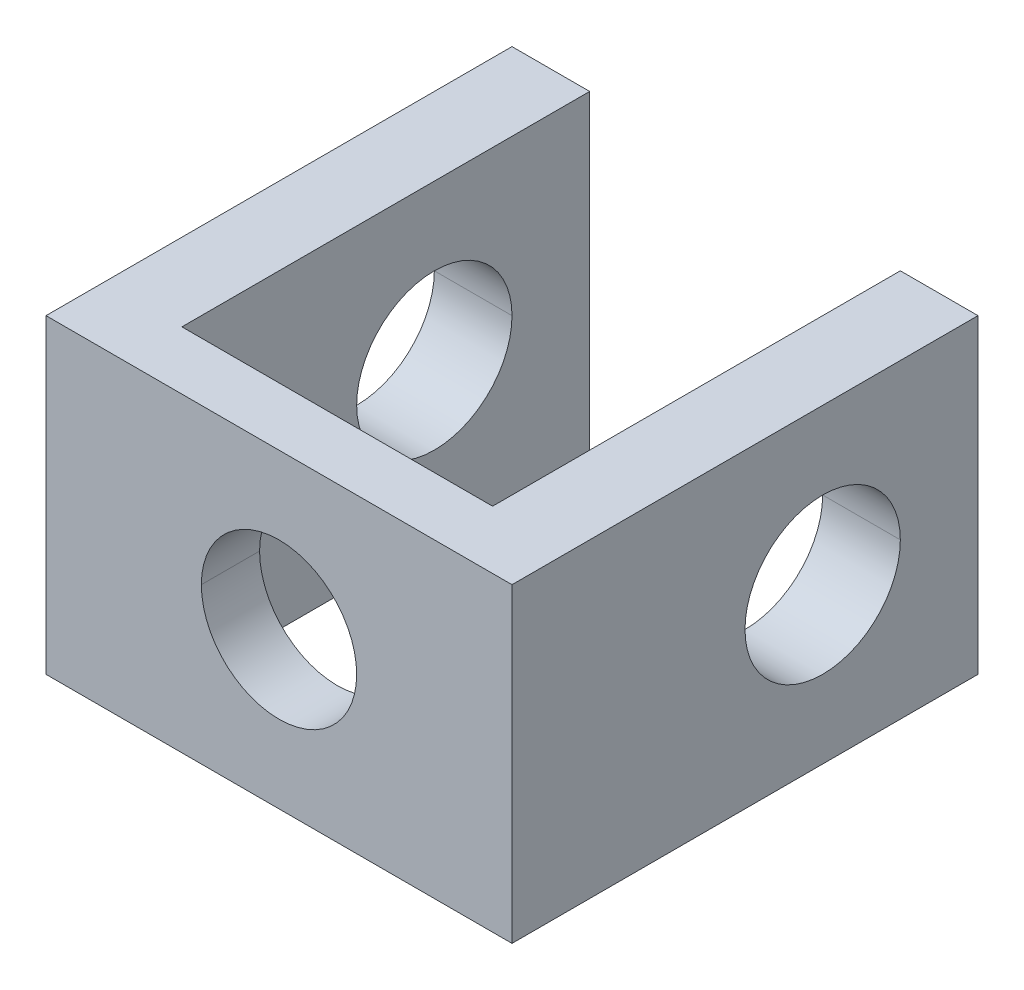
ISO-10303-21;
HEADER;
FILE_DESCRIPTION(('STEP AP214'),'2;1');
FILE_NAME('part.step','',(''),(''),'','','');
FILE_SCHEMA(('AUTOMOTIVE_DESIGN { 1 0 10303 214 1 1 1 1 }'));
ENDSEC;
DATA;
#1=APPLICATION_CONTEXT('core data for automotive mechanical design processes');
#2=APPLICATION_PROTOCOL_DEFINITION('international standard','automotive_design',2000,#1);
#3=PRODUCT_CONTEXT('',#1,'mechanical');
#4=PRODUCT('Part','Part','',(#3));
#5=PRODUCT_RELATED_PRODUCT_CATEGORY('part','',(#4));
#6=PRODUCT_DEFINITION_FORMATION('','',#4);
#7=PRODUCT_DEFINITION_CONTEXT('part definition',#1,'design');
#8=PRODUCT_DEFINITION('design','',#6,#7);
#9=PRODUCT_DEFINITION_SHAPE('','',#8);
#10=(LENGTH_UNIT() NAMED_UNIT(*) SI_UNIT(.MILLI.,.METRE.));
#11=(NAMED_UNIT(*) PLANE_ANGLE_UNIT() SI_UNIT($,.RADIAN.));
#12=(NAMED_UNIT(*) SI_UNIT($,.STERADIAN.) SOLID_ANGLE_UNIT());
#13=UNCERTAINTY_MEASURE_WITH_UNIT(LENGTH_MEASURE(1.E-05),#10,'distance_accuracy_value','');
#14=(GEOMETRIC_REPRESENTATION_CONTEXT(3) GLOBAL_UNCERTAINTY_ASSIGNED_CONTEXT((#13)) GLOBAL_UNIT_ASSIGNED_CONTEXT((#10,
#11,#12)) REPRESENTATION_CONTEXT('',''));
#15=CARTESIAN_POINT('',(0.,0.,0.));
#16=DIRECTION('',(0.,0.,1.));
#17=DIRECTION('',(1.,0.,0.));
#18=AXIS2_PLACEMENT_3D('',#15,#16,#17);
#19=CARTESIAN_POINT('',(0.,4.,1.5));
#20=DIRECTION('',(0.,0.,1.));
#21=DIRECTION('',(1.,0.,0.));
#22=AXIS2_PLACEMENT_3D('',#19,#20,#21);
#23=CYLINDRICAL_SURFACE('',#22,2.);
#24=DIRECTION('',(0.,0.,1.));
#25=VECTOR('',#24,1.);
#26=CARTESIAN_POINT('',(-2.,4.,1.5));
#27=LINE('',#26,#25);
#28=CARTESIAN_POINT('',(-2.,4.,0.));
#29=VERTEX_POINT('',#28);
#30=CARTESIAN_POINT('',(-2.,4.,1.5));
#31=VERTEX_POINT('',#30);
#32=EDGE_CURVE('E270',#29,#31,#27,.T.);
#33=ORIENTED_EDGE('',*,*,#32,.F.);
#34=CARTESIAN_POINT('',(0.,4.,0.));
#35=DIRECTION('',(0.,0.,1.));
#36=DIRECTION('',(1.,0.,0.));
#37=AXIS2_PLACEMENT_3D('',#34,#35,#36);
#38=CIRCLE('',#37,2.);
#39=CARTESIAN_POINT('',(2.,4.,0.));
#40=VERTEX_POINT('',#39);
#41=EDGE_CURVE('E10',#40,#29,#38,.T.);
#42=ORIENTED_EDGE('',*,*,#41,.F.);
#43=DIRECTION('',(0.,0.,1.));
#44=VECTOR('',#43,1.);
#45=CARTESIAN_POINT('',(2.,4.,1.5));
#46=LINE('',#45,#44);
#47=CARTESIAN_POINT('',(2.,4.,1.5));
#48=VERTEX_POINT('',#47);
#49=EDGE_CURVE('E225',#40,#48,#46,.T.);
#50=ORIENTED_EDGE('',*,*,#49,.T.);
#51=CARTESIAN_POINT('',(0.,4.,1.5));
#52=DIRECTION('',(0.,0.,1.));
#53=DIRECTION('',(1.,0.,0.));
#54=AXIS2_PLACEMENT_3D('',#51,#52,#53);
#55=CIRCLE('',#54,2.);
#56=EDGE_CURVE('E139',#48,#31,#55,.T.);
#57=ORIENTED_EDGE('',*,*,#56,.T.);
#58=EDGE_LOOP('',(#33,#42,#50,#57));
#59=FACE_BOUND('',#58,.T.);
#60=ADVANCED_FACE('F15',(#59),#23,.F.);
#61=CARTESIAN_POINT('',(-6.,4.,-6.5));
#62=DIRECTION('',(-1.,0.,0.));
#63=DIRECTION('',(0.,0.,1.));
#64=AXIS2_PLACEMENT_3D('',#61,#62,#63);
#65=CYLINDRICAL_SURFACE('',#64,2.);
#66=DIRECTION('',(-1.,0.,0.));
#67=VECTOR('',#66,1.);
#68=CARTESIAN_POINT('',(-6.,4.,-8.5));
#69=LINE('',#68,#67);
#70=CARTESIAN_POINT('',(-4.,4.,-8.5));
#71=VERTEX_POINT('',#70);
#72=CARTESIAN_POINT('',(-6.,4.,-8.5));
#73=VERTEX_POINT('',#72);
#74=EDGE_CURVE('E208',#71,#73,#69,.T.);
#75=ORIENTED_EDGE('',*,*,#74,.F.);
#76=CARTESIAN_POINT('',(-4.,4.,-6.5));
#77=DIRECTION('',(-1.,0.,0.));
#78=DIRECTION('',(0.,0.,1.));
#79=AXIS2_PLACEMENT_3D('',#76,#77,#78);
#80=CIRCLE('',#79,2.);
#81=CARTESIAN_POINT('',(-4.,4.,-4.5));
#82=VERTEX_POINT('',#81);
#83=EDGE_CURVE('E127',#82,#71,#80,.T.);
#84=ORIENTED_EDGE('',*,*,#83,.F.);
#85=DIRECTION('',(-1.,0.,0.));
#86=VECTOR('',#85,1.);
#87=CARTESIAN_POINT('',(-6.,4.,-4.5));
#88=LINE('',#87,#86);
#89=CARTESIAN_POINT('',(-6.,4.,-4.5));
#90=VERTEX_POINT('',#89);
#91=EDGE_CURVE('E265',#82,#90,#88,.T.);
#92=ORIENTED_EDGE('',*,*,#91,.T.);
#93=CARTESIAN_POINT('',(-6.,4.,-6.5));
#94=DIRECTION('',(-1.,0.,0.));
#95=DIRECTION('',(0.,0.,1.));
#96=AXIS2_PLACEMENT_3D('',#93,#94,#95);
#97=CIRCLE('',#96,2.);
#98=EDGE_CURVE('E234',#90,#73,#97,.T.);
#99=ORIENTED_EDGE('',*,*,#98,.T.);
#100=EDGE_LOOP('',(#75,#84,#92,#99));
#101=FACE_BOUND('',#100,.T.);
#102=ADVANCED_FACE('F421',(#101),#65,.F.);
#103=CARTESIAN_POINT('',(-6.,4.,-6.5));
#104=DIRECTION('',(-1.,0.,0.));
#105=DIRECTION('',(0.,0.,1.));
#106=AXIS2_PLACEMENT_3D('',#103,#104,#105);
#107=CYLINDRICAL_SURFACE('',#106,2.);
#108=DIRECTION('',(-1.,0.,0.));
#109=VECTOR('',#108,1.);
#110=CARTESIAN_POINT('',(-6.,4.,-8.5));
#111=LINE('',#110,#109);
#112=CARTESIAN_POINT('',(6.,4.,-8.5));
#113=VERTEX_POINT('',#112);
#114=CARTESIAN_POINT('',(4.,4.,-8.5));
#115=VERTEX_POINT('',#114);
#116=EDGE_CURVE('E264',#113,#115,#111,.T.);
#117=ORIENTED_EDGE('',*,*,#116,.F.);
#118=CARTESIAN_POINT('',(6.,4.,-6.5));
#119=DIRECTION('',(-1.,0.,0.));
#120=DIRECTION('',(0.,0.,1.));
#121=AXIS2_PLACEMENT_3D('',#118,#119,#120);
#122=CIRCLE('',#121,2.);
#123=CARTESIAN_POINT('',(6.,4.,-4.5));
#124=VERTEX_POINT('',#123);
#125=EDGE_CURVE('E191',#124,#113,#122,.T.);
#126=ORIENTED_EDGE('',*,*,#125,.F.);
#127=DIRECTION('',(-1.,0.,0.));
#128=VECTOR('',#127,1.);
#129=CARTESIAN_POINT('',(-6.,4.,-4.5));
#130=LINE('',#129,#128);
#131=CARTESIAN_POINT('',(4.,4.,-4.5));
#132=VERTEX_POINT('',#131);
#133=EDGE_CURVE('E254',#124,#132,#130,.T.);
#134=ORIENTED_EDGE('',*,*,#133,.T.);
#135=CARTESIAN_POINT('',(4.,4.,-6.5));
#136=DIRECTION('',(1.,0.,0.));
#137=DIRECTION('',(0.,0.,-1.));
#138=AXIS2_PLACEMENT_3D('',#135,#136,#137);
#139=CIRCLE('',#138,2.);
#140=EDGE_CURVE('E172',#115,#132,#139,.T.);
#141=ORIENTED_EDGE('',*,*,#140,.F.);
#142=EDGE_LOOP('',(#117,#126,#134,#141));
#143=FACE_BOUND('',#142,.T.);
#144=ADVANCED_FACE('F410',(#143),#107,.F.);
#145=CARTESIAN_POINT('',(0.,0.,0.));
#146=DIRECTION('',(0.,1.,0.));
#147=DIRECTION('',(1.,0.,0.));
#148=AXIS2_PLACEMENT_3D('',#145,#146,#147);
#149=PLANE('',#148);
#150=DIRECTION('',(0.,0.,-1.));
#151=VECTOR('',#150,1.);
#152=CARTESIAN_POINT('',(-4.,0.,0.));
#153=LINE('',#152,#151);
#154=CARTESIAN_POINT('',(-4.,0.,0.));
#155=VERTEX_POINT('',#154);
#156=CARTESIAN_POINT('',(-4.,0.,-10.5));
#157=VERTEX_POINT('',#156);
#158=EDGE_CURVE('E233',#155,#157,#153,.T.);
#159=ORIENTED_EDGE('',*,*,#158,.F.);
#160=DIRECTION('',(-1.,0.,0.));
#161=VECTOR('',#160,1.);
#162=CARTESIAN_POINT('',(4.,0.,0.));
#163=LINE('',#162,#161);
#164=CARTESIAN_POINT('',(4.,0.,0.));
#165=VERTEX_POINT('',#164);
#166=EDGE_CURVE('E207',#165,#155,#163,.T.);
#167=ORIENTED_EDGE('',*,*,#166,.F.);
#168=DIRECTION('',(0.,0.,1.));
#169=VECTOR('',#168,1.);
#170=CARTESIAN_POINT('',(4.,0.,0.));
#171=LINE('',#170,#169);
#172=CARTESIAN_POINT('',(4.,0.,-10.5));
#173=VERTEX_POINT('',#172);
#174=EDGE_CURVE('E180',#173,#165,#171,.T.);
#175=ORIENTED_EDGE('',*,*,#174,.F.);
#176=DIRECTION('',(-1.,0.,0.));
#177=VECTOR('',#176,1.);
#178=CARTESIAN_POINT('',(4.,0.,-10.5));
#179=LINE('',#178,#177);
#180=CARTESIAN_POINT('',(6.,0.,-10.5));
#181=VERTEX_POINT('',#180);
#182=EDGE_CURVE('E183',#181,#173,#179,.T.);
#183=ORIENTED_EDGE('',*,*,#182,.F.);
#184=DIRECTION('',(0.,0.,-1.));
#185=VECTOR('',#184,1.);
#186=CARTESIAN_POINT('',(6.,0.,-10.5));
#187=LINE('',#186,#185);
#188=CARTESIAN_POINT('',(6.,0.,1.5));
#189=VERTEX_POINT('',#188);
#190=EDGE_CURVE('E112',#189,#181,#187,.T.);
#191=ORIENTED_EDGE('',*,*,#190,.F.);
#192=DIRECTION('',(1.,0.,0.));
#193=VECTOR('',#192,1.);
#194=CARTESIAN_POINT('',(-6.,0.,1.5));
#195=LINE('',#194,#193);
#196=CARTESIAN_POINT('',(-6.,0.,1.5));
#197=VERTEX_POINT('',#196);
#198=EDGE_CURVE('E238',#197,#189,#195,.T.);
#199=ORIENTED_EDGE('',*,*,#198,.F.);
#200=DIRECTION('',(0.,0.,1.));
#201=VECTOR('',#200,1.);
#202=CARTESIAN_POINT('',(-6.,0.,-10.5));
#203=LINE('',#202,#201);
#204=CARTESIAN_POINT('',(-6.,0.,-10.5));
#205=VERTEX_POINT('',#204);
#206=EDGE_CURVE('E18',#205,#197,#203,.T.);
#207=ORIENTED_EDGE('',*,*,#206,.F.);
#208=DIRECTION('',(-1.,0.,0.));
#209=VECTOR('',#208,1.);
#210=CARTESIAN_POINT('',(-4.,0.,-10.5));
#211=LINE('',#210,#209);
#212=EDGE_CURVE('E196',#157,#205,#211,.T.);
#213=ORIENTED_EDGE('',*,*,#212,.F.);
#214=EDGE_LOOP('',(#159,#167,#175,#183,#191,#199,#207,#213));
#215=FACE_BOUND('',#214,.T.);
#216=ADVANCED_FACE('F330',(#215),#149,.F.);
#217=CARTESIAN_POINT('',(0.,8.,0.));
#218=DIRECTION('',(0.,1.,0.));
#219=DIRECTION('',(1.,0.,0.));
#220=AXIS2_PLACEMENT_3D('',#217,#218,#219);
#221=PLANE('',#220);
#222=DIRECTION('',(0.,0.,-1.));
#223=VECTOR('',#222,1.);
#224=CARTESIAN_POINT('',(-4.,8.,0.));
#225=LINE('',#224,#223);
#226=CARTESIAN_POINT('',(-4.,8.,0.));
#227=VERTEX_POINT('',#226);
#228=CARTESIAN_POINT('',(-4.,8.,-10.5));
#229=VERTEX_POINT('',#228);
#230=EDGE_CURVE('E204',#227,#229,#225,.T.);
#231=ORIENTED_EDGE('',*,*,#230,.T.);
#232=DIRECTION('',(-1.,0.,0.));
#233=VECTOR('',#232,1.);
#234=CARTESIAN_POINT('',(-4.,8.,-10.5));
#235=LINE('',#234,#233);
#236=CARTESIAN_POINT('',(-6.,8.,-10.5));
#237=VERTEX_POINT('',#236);
#238=EDGE_CURVE('E222',#229,#237,#235,.T.);
#239=ORIENTED_EDGE('',*,*,#238,.T.);
#240=DIRECTION('',(0.,0.,1.));
#241=VECTOR('',#240,1.);
#242=CARTESIAN_POINT('',(-6.,8.,-10.5));
#243=LINE('',#242,#241);
#244=CARTESIAN_POINT('',(-6.,8.,1.5));
#245=VERTEX_POINT('',#244);
#246=EDGE_CURVE('E239',#237,#245,#243,.T.);
#247=ORIENTED_EDGE('',*,*,#246,.T.);
#248=DIRECTION('',(1.,0.,0.));
#249=VECTOR('',#248,1.);
#250=CARTESIAN_POINT('',(-6.,8.,1.5));
#251=LINE('',#250,#249);
#252=CARTESIAN_POINT('',(6.,8.,1.5));
#253=VERTEX_POINT('',#252);
#254=EDGE_CURVE('E314',#245,#253,#251,.T.);
#255=ORIENTED_EDGE('',*,*,#254,.T.);
#256=DIRECTION('',(0.,0.,-1.));
#257=VECTOR('',#256,1.);
#258=CARTESIAN_POINT('',(6.,8.,-10.5));
#259=LINE('',#258,#257);
#260=CARTESIAN_POINT('',(6.,8.,-10.5));
#261=VERTEX_POINT('',#260);
#262=EDGE_CURVE('E96',#253,#261,#259,.T.);
#263=ORIENTED_EDGE('',*,*,#262,.T.);
#264=DIRECTION('',(-1.,0.,0.));
#265=VECTOR('',#264,1.);
#266=CARTESIAN_POINT('',(4.,8.,-10.5));
#267=LINE('',#266,#265);
#268=CARTESIAN_POINT('',(4.,8.,-10.5));
#269=VERTEX_POINT('',#268);
#270=EDGE_CURVE('E174',#261,#269,#267,.T.);
#271=ORIENTED_EDGE('',*,*,#270,.T.);
#272=DIRECTION('',(0.,0.,1.));
#273=VECTOR('',#272,1.);
#274=CARTESIAN_POINT('',(4.,8.,0.));
#275=LINE('',#274,#273);
#276=CARTESIAN_POINT('',(4.,8.,0.));
#277=VERTEX_POINT('',#276);
#278=EDGE_CURVE('E162',#269,#277,#275,.T.);
#279=ORIENTED_EDGE('',*,*,#278,.T.);
#280=DIRECTION('',(-1.,0.,0.));
#281=VECTOR('',#280,1.);
#282=CARTESIAN_POINT('',(4.,8.,0.));
#283=LINE('',#282,#281);
#284=EDGE_CURVE('E25',#277,#227,#283,.T.);
#285=ORIENTED_EDGE('',*,*,#284,.T.);
#286=EDGE_LOOP('',(#231,#239,#247,#255,#263,#271,#279,#285));
#287=FACE_BOUND('',#286,.T.);
#288=ADVANCED_FACE('F176',(#287),#221,.T.);
#289=CARTESIAN_POINT('',(4.,8.,0.));
#290=DIRECTION('',(0.,0.,1.));
#291=DIRECTION('',(1.,0.,0.));
#292=AXIS2_PLACEMENT_3D('',#289,#290,#291);
#293=PLANE('',#292);
#294=ORIENTED_EDGE('',*,*,#41,.T.);
#295=CARTESIAN_POINT('',(0.,4.,0.));
#296=DIRECTION('',(0.,0.,1.));
#297=DIRECTION('',(1.,0.,0.));
#298=AXIS2_PLACEMENT_3D('',#295,#296,#297);
#299=CIRCLE('',#298,2.);
#300=EDGE_CURVE('E273',#29,#40,#299,.T.);
#301=ORIENTED_EDGE('',*,*,#300,.T.);
#302=EDGE_LOOP('',(#294,#301));
#303=FACE_BOUND('',#302,.T.);
#304=ORIENTED_EDGE('',*,*,#166,.T.);
#305=DIRECTION('',(0.,-1.,0.));
#306=VECTOR('',#305,1.);
#307=CARTESIAN_POINT('',(-4.,8.,0.));
#308=LINE('',#307,#306);
#309=EDGE_CURVE('E200',#227,#155,#308,.T.);
#310=ORIENTED_EDGE('',*,*,#309,.F.);
#311=ORIENTED_EDGE('',*,*,#284,.F.);
#312=DIRECTION('',(0.,-1.,0.));
#313=VECTOR('',#312,1.);
#314=CARTESIAN_POINT('',(4.,8.,0.));
#315=LINE('',#314,#313);
#316=EDGE_CURVE('E169',#277,#165,#315,.T.);
#317=ORIENTED_EDGE('',*,*,#316,.T.);
#318=EDGE_LOOP('',(#304,#310,#311,#317));
#319=FACE_BOUND('',#318,.T.);
#320=ADVANCED_FACE('F322',(#303,#319),#293,.F.);
#321=CARTESIAN_POINT('',(4.,8.,0.));
#322=DIRECTION('',(1.,0.,0.));
#323=DIRECTION('',(0.,1.,0.));
#324=AXIS2_PLACEMENT_3D('',#321,#322,#323);
#325=PLANE('',#324);
#326=CARTESIAN_POINT('',(4.,4.,-6.5));
#327=DIRECTION('',(1.,0.,0.));
#328=DIRECTION('',(0.,0.,-1.));
#329=AXIS2_PLACEMENT_3D('',#326,#327,#328);
#330=CIRCLE('',#329,2.);
#331=EDGE_CURVE('E296',#132,#115,#330,.T.);
#332=ORIENTED_EDGE('',*,*,#331,.T.);
#333=ORIENTED_EDGE('',*,*,#140,.T.);
#334=EDGE_LOOP('',(#332,#333));
#335=FACE_BOUND('',#334,.T.);
#336=ORIENTED_EDGE('',*,*,#174,.T.);
#337=ORIENTED_EDGE('',*,*,#316,.F.);
#338=ORIENTED_EDGE('',*,*,#278,.F.);
#339=DIRECTION('',(0.,-1.,0.));
#340=VECTOR('',#339,1.);
#341=CARTESIAN_POINT('',(4.,8.,-10.5));
#342=LINE('',#341,#340);
#343=EDGE_CURVE('E167',#269,#173,#342,.T.);
#344=ORIENTED_EDGE('',*,*,#343,.T.);
#345=EDGE_LOOP('',(#336,#337,#338,#344));
#346=FACE_BOUND('',#345,.T.);
#347=ADVANCED_FACE('F165',(#335,#346),#325,.F.);
#348=CARTESIAN_POINT('',(4.,8.,-10.5));
#349=DIRECTION('',(0.,0.,1.));
#350=DIRECTION('',(1.,0.,0.));
#351=AXIS2_PLACEMENT_3D('',#348,#349,#350);
#352=PLANE('',#351);
#353=ORIENTED_EDGE('',*,*,#182,.T.);
#354=ORIENTED_EDGE('',*,*,#343,.F.);
#355=ORIENTED_EDGE('',*,*,#270,.F.);
#356=DIRECTION('',(0.,-1.,0.));
#357=VECTOR('',#356,1.);
#358=CARTESIAN_POINT('',(6.,8.,-10.5));
#359=LINE('',#358,#357);
#360=EDGE_CURVE('E218',#261,#181,#359,.T.);
#361=ORIENTED_EDGE('',*,*,#360,.T.);
#362=EDGE_LOOP('',(#353,#354,#355,#361));
#363=FACE_BOUND('',#362,.T.);
#364=ADVANCED_FACE('F182',(#363),#352,.F.);
#365=CARTESIAN_POINT('',(6.,8.,-10.5));
#366=DIRECTION('',(-1.,0.,0.));
#367=DIRECTION('',(0.,0.,1.));
#368=AXIS2_PLACEMENT_3D('',#365,#366,#367);
#369=PLANE('',#368);
#370=ORIENTED_EDGE('',*,*,#125,.T.);
#371=CARTESIAN_POINT('',(6.,4.,-6.5));
#372=DIRECTION('',(-1.,0.,0.));
#373=DIRECTION('',(0.,0.,1.));
#374=AXIS2_PLACEMENT_3D('',#371,#372,#373);
#375=CIRCLE('',#374,2.);
#376=EDGE_CURVE('E260',#113,#124,#375,.T.);
#377=ORIENTED_EDGE('',*,*,#376,.T.);
#378=EDGE_LOOP('',(#370,#377));
#379=FACE_BOUND('',#378,.T.);
#380=ORIENTED_EDGE('',*,*,#190,.T.);
#381=ORIENTED_EDGE('',*,*,#360,.F.);
#382=ORIENTED_EDGE('',*,*,#262,.F.);
#383=DIRECTION('',(0.,-1.,0.));
#384=VECTOR('',#383,1.);
#385=CARTESIAN_POINT('',(6.,8.,1.5));
#386=LINE('',#385,#384);
#387=EDGE_CURVE('E194',#253,#189,#386,.T.);
#388=ORIENTED_EDGE('',*,*,#387,.T.);
#389=EDGE_LOOP('',(#380,#381,#382,#388));
#390=FACE_BOUND('',#389,.T.);
#391=ADVANCED_FACE('F441',(#379,#390),#369,.F.);
#392=CARTESIAN_POINT('',(-6.,8.,1.5));
#393=DIRECTION('',(0.,0.,-1.));
#394=DIRECTION('',(0.,-1.,0.));
#395=AXIS2_PLACEMENT_3D('',#392,#393,#394);
#396=PLANE('',#395);
#397=ORIENTED_EDGE('',*,*,#56,.F.);
#398=CARTESIAN_POINT('',(0.,4.,1.5));
#399=DIRECTION('',(0.,0.,1.));
#400=DIRECTION('',(1.,0.,0.));
#401=AXIS2_PLACEMENT_3D('',#398,#399,#400);
#402=CIRCLE('',#401,2.);
#403=EDGE_CURVE('E228',#31,#48,#402,.T.);
#404=ORIENTED_EDGE('',*,*,#403,.F.);
#405=EDGE_LOOP('',(#397,#404));
#406=FACE_BOUND('',#405,.T.);
#407=ORIENTED_EDGE('',*,*,#198,.T.);
#408=ORIENTED_EDGE('',*,*,#387,.F.);
#409=ORIENTED_EDGE('',*,*,#254,.F.);
#410=DIRECTION('',(0.,-1.,0.));
#411=VECTOR('',#410,1.);
#412=CARTESIAN_POINT('',(-6.,8.,1.5));
#413=LINE('',#412,#411);
#414=EDGE_CURVE('E245',#245,#197,#413,.T.);
#415=ORIENTED_EDGE('',*,*,#414,.T.);
#416=EDGE_LOOP('',(#407,#408,#409,#415));
#417=FACE_BOUND('',#416,.T.);
#418=ADVANCED_FACE('F348',(#406,#417),#396,.F.);
#419=CARTESIAN_POINT('',(-6.,8.,-10.5));
#420=DIRECTION('',(1.,0.,0.));
#421=DIRECTION('',(0.,0.,-1.));
#422=AXIS2_PLACEMENT_3D('',#419,#420,#421);
#423=PLANE('',#422);
#424=ORIENTED_EDGE('',*,*,#98,.F.);
#425=CARTESIAN_POINT('',(-6.,4.,-6.5));
#426=DIRECTION('',(-1.,0.,0.));
#427=DIRECTION('',(0.,0.,1.));
#428=AXIS2_PLACEMENT_3D('',#425,#426,#427);
#429=CIRCLE('',#428,2.);
#430=EDGE_CURVE('E212',#73,#90,#429,.T.);
#431=ORIENTED_EDGE('',*,*,#430,.F.);
#432=EDGE_LOOP('',(#424,#431));
#433=FACE_BOUND('',#432,.T.);
#434=ORIENTED_EDGE('',*,*,#206,.T.);
#435=ORIENTED_EDGE('',*,*,#414,.F.);
#436=ORIENTED_EDGE('',*,*,#246,.F.);
#437=DIRECTION('',(0.,-1.,0.));
#438=VECTOR('',#437,1.);
#439=CARTESIAN_POINT('',(-6.,8.,-10.5));
#440=LINE('',#439,#438);
#441=EDGE_CURVE('E199',#237,#205,#440,.T.);
#442=ORIENTED_EDGE('',*,*,#441,.T.);
#443=EDGE_LOOP('',(#434,#435,#436,#442));
#444=FACE_BOUND('',#443,.T.);
#445=ADVANCED_FACE('F349',(#433,#444),#423,.F.);
#446=CARTESIAN_POINT('',(-4.,8.,-10.5));
#447=DIRECTION('',(0.,0.,1.));
#448=DIRECTION('',(1.,0.,0.));
#449=AXIS2_PLACEMENT_3D('',#446,#447,#448);
#450=PLANE('',#449);
#451=ORIENTED_EDGE('',*,*,#212,.T.);
#452=ORIENTED_EDGE('',*,*,#441,.F.);
#453=ORIENTED_EDGE('',*,*,#238,.F.);
#454=DIRECTION('',(0.,-1.,0.));
#455=VECTOR('',#454,1.);
#456=CARTESIAN_POINT('',(-4.,8.,-10.5));
#457=LINE('',#456,#455);
#458=EDGE_CURVE('E229',#229,#157,#457,.T.);
#459=ORIENTED_EDGE('',*,*,#458,.T.);
#460=EDGE_LOOP('',(#451,#452,#453,#459));
#461=FACE_BOUND('',#460,.T.);
#462=ADVANCED_FACE('F334',(#461),#450,.F.);
#463=CARTESIAN_POINT('',(-4.,8.,0.));
#464=DIRECTION('',(-1.,0.,0.));
#465=DIRECTION('',(0.,0.,1.));
#466=AXIS2_PLACEMENT_3D('',#463,#464,#465);
#467=PLANE('',#466);
#468=ORIENTED_EDGE('',*,*,#83,.T.);
#469=CARTESIAN_POINT('',(-4.,4.,-6.5));
#470=DIRECTION('',(-1.,0.,0.));
#471=DIRECTION('',(0.,0.,1.));
#472=AXIS2_PLACEMENT_3D('',#469,#470,#471);
#473=CIRCLE('',#472,2.);
#474=EDGE_CURVE('E213',#71,#82,#473,.T.);
#475=ORIENTED_EDGE('',*,*,#474,.T.);
#476=EDGE_LOOP('',(#468,#475));
#477=FACE_BOUND('',#476,.T.);
#478=ORIENTED_EDGE('',*,*,#158,.T.);
#479=ORIENTED_EDGE('',*,*,#458,.F.);
#480=ORIENTED_EDGE('',*,*,#230,.F.);
#481=ORIENTED_EDGE('',*,*,#309,.T.);
#482=EDGE_LOOP('',(#478,#479,#480,#481));
#483=FACE_BOUND('',#482,.T.);
#484=ADVANCED_FACE('F328',(#477,#483),#467,.F.);
#485=CARTESIAN_POINT('',(-6.,4.,-6.5));
#486=DIRECTION('',(-1.,0.,0.));
#487=DIRECTION('',(0.,0.,1.));
#488=AXIS2_PLACEMENT_3D('',#485,#486,#487);
#489=CYLINDRICAL_SURFACE('',#488,2.);
#490=ORIENTED_EDGE('',*,*,#376,.F.);
#491=ORIENTED_EDGE('',*,*,#116,.T.);
#492=ORIENTED_EDGE('',*,*,#331,.F.);
#493=ORIENTED_EDGE('',*,*,#133,.F.);
#494=EDGE_LOOP('',(#490,#491,#492,#493));
#495=FACE_BOUND('',#494,.T.);
#496=ADVANCED_FACE('F432',(#495),#489,.F.);
#497=CARTESIAN_POINT('',(-6.,4.,-6.5));
#498=DIRECTION('',(-1.,0.,0.));
#499=DIRECTION('',(0.,0.,1.));
#500=AXIS2_PLACEMENT_3D('',#497,#498,#499);
#501=CYLINDRICAL_SURFACE('',#500,2.);
#502=ORIENTED_EDGE('',*,*,#474,.F.);
#503=ORIENTED_EDGE('',*,*,#74,.T.);
#504=ORIENTED_EDGE('',*,*,#430,.T.);
#505=ORIENTED_EDGE('',*,*,#91,.F.);
#506=EDGE_LOOP('',(#502,#503,#504,#505));
#507=FACE_BOUND('',#506,.T.);
#508=ADVANCED_FACE('F379',(#507),#501,.F.);
#509=CARTESIAN_POINT('',(0.,4.,1.5));
#510=DIRECTION('',(0.,0.,1.));
#511=DIRECTION('',(1.,0.,0.));
#512=AXIS2_PLACEMENT_3D('',#509,#510,#511);
#513=CYLINDRICAL_SURFACE('',#512,2.);
#514=ORIENTED_EDGE('',*,*,#300,.F.);
#515=ORIENTED_EDGE('',*,*,#32,.T.);
#516=ORIENTED_EDGE('',*,*,#403,.T.);
#517=ORIENTED_EDGE('',*,*,#49,.F.);
#518=EDGE_LOOP('',(#514,#515,#516,#517));
#519=FACE_BOUND('',#518,.T.);
#520=ADVANCED_FACE('F374',(#519),#513,.F.);
#521=CLOSED_SHELL('',(#60,#102,#144,#216,#288,#320,#347,#364,#391,#418,#445,#462,#484,#496,#508,#520));
#522=MANIFOLD_SOLID_BREP('B1',#521);
#523=ADVANCED_BREP_SHAPE_REPRESENTATION('',(#18,#522),#14);
#524=SHAPE_DEFINITION_REPRESENTATION(#9,#523);
ENDSEC;
END-ISO-10303-21;
